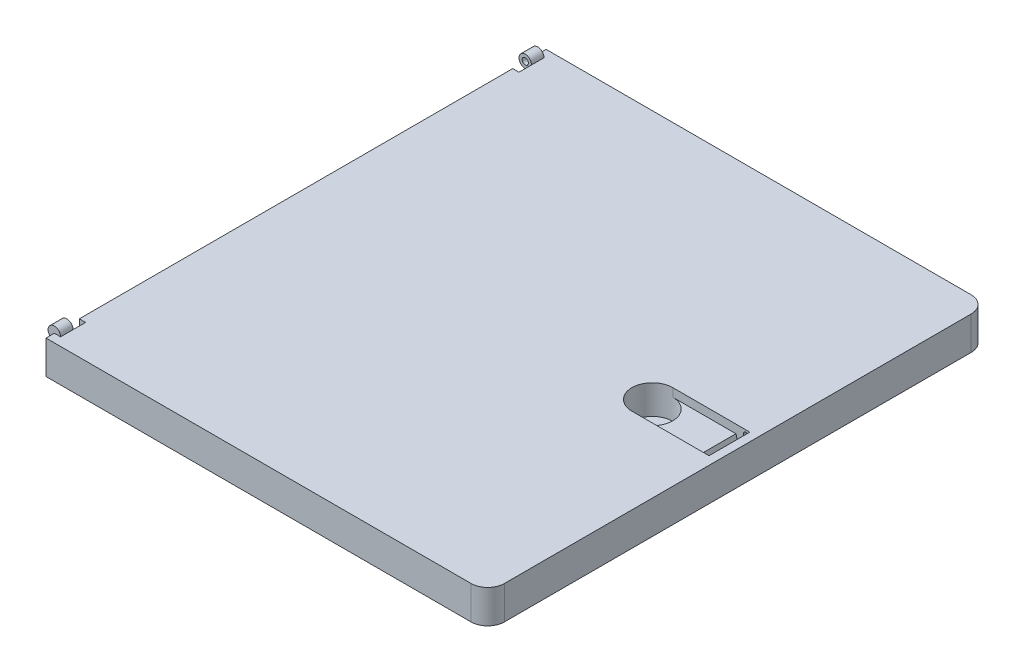
ISO-10303-21;
HEADER;
FILE_DESCRIPTION(('STEP AP214'),'2;1');
FILE_NAME('part.step','',(''),(''),'','','');
FILE_SCHEMA(('AUTOMOTIVE_DESIGN { 1 0 10303 214 1 1 1 1 }'));
ENDSEC;
DATA;
#1=APPLICATION_CONTEXT('core data for automotive mechanical design processes');
#2=APPLICATION_PROTOCOL_DEFINITION('international standard','automotive_design',2000,#1);
#3=PRODUCT_CONTEXT('',#1,'mechanical');
#4=PRODUCT('Part','Part','',(#3));
#5=PRODUCT_RELATED_PRODUCT_CATEGORY('part','',(#4));
#6=PRODUCT_DEFINITION_FORMATION('','',#4);
#7=PRODUCT_DEFINITION_CONTEXT('part definition',#1,'design');
#8=PRODUCT_DEFINITION('design','',#6,#7);
#9=PRODUCT_DEFINITION_SHAPE('','',#8);
#10=(LENGTH_UNIT() NAMED_UNIT(*) SI_UNIT(.MILLI.,.METRE.));
#11=(NAMED_UNIT(*) PLANE_ANGLE_UNIT() SI_UNIT($,.RADIAN.));
#12=(NAMED_UNIT(*) SI_UNIT($,.STERADIAN.) SOLID_ANGLE_UNIT());
#13=UNCERTAINTY_MEASURE_WITH_UNIT(LENGTH_MEASURE(1.E-05),#10,'distance_accuracy_value','');
#14=(GEOMETRIC_REPRESENTATION_CONTEXT(3) GLOBAL_UNCERTAINTY_ASSIGNED_CONTEXT((#13)) GLOBAL_UNIT_ASSIGNED_CONTEXT((#10,
#11,#12)) REPRESENTATION_CONTEXT('',''));
#15=CARTESIAN_POINT('',(0.,0.,0.));
#16=DIRECTION('',(0.,0.,1.));
#17=DIRECTION('',(1.,0.,0.));
#18=AXIS2_PLACEMENT_3D('',#15,#16,#17);
#19=CARTESIAN_POINT('',(-106.,-8.,0.));
#20=DIRECTION('',(-1.,0.,0.));
#21=DIRECTION('',(0.,0.,1.));
#22=AXIS2_PLACEMENT_3D('',#19,#20,#21);
#23=PLANE('',#22);
#24=DIRECTION('',(0.,-1.,0.));
#25=VECTOR('',#24,1.);
#26=CARTESIAN_POINT('',(-106.,-8.,-52.));
#27=LINE('',#26,#25);
#28=CARTESIAN_POINT('',(-106.,0.,-52.));
#29=VERTEX_POINT('',#28);
#30=CARTESIAN_POINT('',(-106.,-1.5,-52.));
#31=VERTEX_POINT('',#30);
#32=EDGE_CURVE('E476',#29,#31,#27,.T.);
#33=ORIENTED_EDGE('',*,*,#32,.T.);
#34=DIRECTION('',(0.,0.,-1.));
#35=VECTOR('',#34,1.);
#36=CARTESIAN_POINT('',(-106.,-1.5,-52.));
#37=LINE('',#36,#35);
#38=CARTESIAN_POINT('',(-106.,-1.5,-55.));
#39=VERTEX_POINT('',#38);
#40=EDGE_CURVE('E226',#31,#39,#37,.T.);
#41=ORIENTED_EDGE('',*,*,#40,.T.);
#42=DIRECTION('',(0.,0.,1.));
#43=VECTOR('',#42,1.);
#44=CARTESIAN_POINT('',(-106.,-1.5,-58.));
#45=LINE('',#44,#43);
#46=CARTESIAN_POINT('',(-106.,-1.5,-58.));
#47=VERTEX_POINT('',#46);
#48=EDGE_CURVE('E48',#47,#39,#45,.T.);
#49=ORIENTED_EDGE('',*,*,#48,.F.);
#50=DIRECTION('',(0.,-1.,0.));
#51=VECTOR('',#50,1.);
#52=CARTESIAN_POINT('',(-106.,-8.,-58.));
#53=LINE('',#52,#51);
#54=CARTESIAN_POINT('',(-106.,0.,-58.));
#55=VERTEX_POINT('',#54);
#56=EDGE_CURVE('E246',#55,#47,#53,.T.);
#57=ORIENTED_EDGE('',*,*,#56,.F.);
#58=DIRECTION('',(0.,0.,1.));
#59=VECTOR('',#58,1.);
#60=CARTESIAN_POINT('',(-106.,0.,0.));
#61=LINE('',#60,#59);
#62=CARTESIAN_POINT('',(-106.,0.,-60.));
#63=VERTEX_POINT('',#62);
#64=EDGE_CURVE('E411',#63,#55,#61,.T.);
#65=ORIENTED_EDGE('',*,*,#64,.F.);
#66=DIRECTION('',(0.,1.,0.));
#67=VECTOR('',#66,1.);
#68=CARTESIAN_POINT('',(-106.,-8.,-60.));
#69=LINE('',#68,#67);
#70=CARTESIAN_POINT('',(-106.,-8.,-60.));
#71=VERTEX_POINT('',#70);
#72=EDGE_CURVE('E405',#71,#63,#69,.T.);
#73=ORIENTED_EDGE('',*,*,#72,.F.);
#74=DIRECTION('',(0.,0.,1.));
#75=VECTOR('',#74,1.);
#76=CARTESIAN_POINT('',(-106.,-8.,0.));
#77=LINE('',#76,#75);
#78=CARTESIAN_POINT('',(-106.,-8.,60.));
#79=VERTEX_POINT('',#78);
#80=EDGE_CURVE('E400',#71,#79,#77,.T.);
#81=ORIENTED_EDGE('',*,*,#80,.T.);
#82=DIRECTION('',(0.,1.,0.));
#83=VECTOR('',#82,1.);
#84=CARTESIAN_POINT('',(-106.,-8.,60.));
#85=LINE('',#84,#83);
#86=CARTESIAN_POINT('',(-106.,0.,60.));
#87=VERTEX_POINT('',#86);
#88=EDGE_CURVE('E416',#79,#87,#85,.T.);
#89=ORIENTED_EDGE('',*,*,#88,.T.);
#90=CARTESIAN_POINT('',(-106.,0.,58.));
#91=VERTEX_POINT('',#90);
#92=EDGE_CURVE('E410',#91,#87,#61,.T.);
#93=ORIENTED_EDGE('',*,*,#92,.F.);
#94=DIRECTION('',(0.,1.,0.));
#95=VECTOR('',#94,1.);
#96=CARTESIAN_POINT('',(-106.,-8.,58.));
#97=LINE('',#96,#95);
#98=CARTESIAN_POINT('',(-106.,-1.5,58.));
#99=VERTEX_POINT('',#98);
#100=EDGE_CURVE('E278',#99,#91,#97,.T.);
#101=ORIENTED_EDGE('',*,*,#100,.F.);
#102=DIRECTION('',(0.,0.,-1.));
#103=VECTOR('',#102,1.);
#104=CARTESIAN_POINT('',(-106.,-1.5,58.));
#105=LINE('',#104,#103);
#106=CARTESIAN_POINT('',(-106.,-1.5,55.));
#107=VERTEX_POINT('',#106);
#108=EDGE_CURVE('E283',#99,#107,#105,.T.);
#109=ORIENTED_EDGE('',*,*,#108,.T.);
#110=DIRECTION('',(0.,0.,1.));
#111=VECTOR('',#110,1.);
#112=CARTESIAN_POINT('',(-106.,-1.5,52.));
#113=LINE('',#112,#111);
#114=CARTESIAN_POINT('',(-106.,-1.5,52.));
#115=VERTEX_POINT('',#114);
#116=EDGE_CURVE('E263',#115,#107,#113,.T.);
#117=ORIENTED_EDGE('',*,*,#116,.F.);
#118=DIRECTION('',(0.,1.,0.));
#119=VECTOR('',#118,1.);
#120=CARTESIAN_POINT('',(-106.,-8.,52.));
#121=LINE('',#120,#119);
#122=CARTESIAN_POINT('',(-106.,0.,52.));
#123=VERTEX_POINT('',#122);
#124=EDGE_CURVE('E265',#115,#123,#121,.T.);
#125=ORIENTED_EDGE('',*,*,#124,.T.);
#126=EDGE_CURVE('E413',#29,#123,#61,.T.);
#127=ORIENTED_EDGE('',*,*,#126,.F.);
#128=EDGE_LOOP('',(#33,#41,#49,#57,#65,#73,#81,#89,#93,#101,#109,#117,#125,#127));
#129=FACE_BOUND('',#128,.T.);
#130=ADVANCED_FACE('F33',(#129),#23,.T.);
#131=CARTESIAN_POINT('',(0.,0.,0.));
#132=DIRECTION('',(0.,-1.,0.));
#133=DIRECTION('',(0.,0.,-1.));
#134=AXIS2_PLACEMENT_3D('',#131,#132,#133);
#135=PLANE('',#134);
#136=DIRECTION('',(0.,0.,-1.));
#137=VECTOR('',#136,1.);
#138=CARTESIAN_POINT('',(-2.,0.,0.));
#139=LINE('',#138,#137);
#140=CARTESIAN_POINT('',(-2.,0.,4.9));
#141=VERTEX_POINT('',#140);
#142=CARTESIAN_POINT('',(-2.,0.,-4.9));
#143=VERTEX_POINT('',#142);
#144=EDGE_CURVE('E366',#141,#143,#139,.T.);
#145=ORIENTED_EDGE('',*,*,#144,.F.);
#146=DIRECTION('',(1.,0.,0.));
#147=VECTOR('',#146,1.);
#148=CARTESIAN_POINT('',(-2.,0.,4.9));
#149=LINE('',#148,#147);
#150=CARTESIAN_POINT('',(-20.5,0.,4.9));
#151=VERTEX_POINT('',#150);
#152=EDGE_CURVE('E372',#151,#141,#149,.T.);
#153=ORIENTED_EDGE('',*,*,#152,.F.);
#154=CARTESIAN_POINT('',(-20.5,0.,0.));
#155=DIRECTION('',(0.,1.,0.));
#156=DIRECTION('',(0.,0.,1.));
#157=AXIS2_PLACEMENT_3D('',#154,#155,#156);
#158=CIRCLE('',#157,4.9);
#159=CARTESIAN_POINT('',(-20.5,0.,-4.9));
#160=VERTEX_POINT('',#159);
#161=EDGE_CURVE('E381',#160,#151,#158,.T.);
#162=ORIENTED_EDGE('',*,*,#161,.F.);
#163=DIRECTION('',(-1.,0.,0.));
#164=VECTOR('',#163,1.);
#165=CARTESIAN_POINT('',(-2.,0.,-4.9));
#166=LINE('',#165,#164);
#167=EDGE_CURVE('E378',#143,#160,#166,.T.);
#168=ORIENTED_EDGE('',*,*,#167,.F.);
#169=EDGE_LOOP('',(#145,#153,#162,#168));
#170=FACE_BOUND('',#169,.T.);
#171=DIRECTION('',(0.,0.,-1.));
#172=VECTOR('',#171,1.);
#173=CARTESIAN_POINT('',(-104.5,0.,-52.));
#174=LINE('',#173,#172);
#175=CARTESIAN_POINT('',(-104.5,0.,-52.));
#176=VERTEX_POINT('',#175);
#177=CARTESIAN_POINT('',(-104.5,0.,-55.));
#178=VERTEX_POINT('',#177);
#179=EDGE_CURVE('E219',#176,#178,#174,.T.);
#180=ORIENTED_EDGE('',*,*,#179,.F.);
#181=DIRECTION('',(1.,0.,0.));
#182=VECTOR('',#181,1.);
#183=CARTESIAN_POINT('',(0.,0.,-52.));
#184=LINE('',#183,#182);
#185=EDGE_CURVE('E11',#29,#176,#184,.T.);
#186=ORIENTED_EDGE('',*,*,#185,.F.);
#187=ORIENTED_EDGE('',*,*,#126,.T.);
#188=DIRECTION('',(-1.,0.,0.));
#189=VECTOR('',#188,1.);
#190=CARTESIAN_POINT('',(0.,0.,52.));
#191=LINE('',#190,#189);
#192=CARTESIAN_POINT('',(-104.5,0.,52.));
#193=VERTEX_POINT('',#192);
#194=EDGE_CURVE('E240',#193,#123,#191,.T.);
#195=ORIENTED_EDGE('',*,*,#194,.F.);
#196=DIRECTION('',(0.,0.,1.));
#197=VECTOR('',#196,1.);
#198=CARTESIAN_POINT('',(-104.5,0.,52.));
#199=LINE('',#198,#197);
#200=CARTESIAN_POINT('',(-104.5,0.,55.));
#201=VERTEX_POINT('',#200);
#202=EDGE_CURVE('E259',#193,#201,#199,.T.);
#203=ORIENTED_EDGE('',*,*,#202,.T.);
#204=DIRECTION('',(0.,0.,-1.));
#205=VECTOR('',#204,1.);
#206=CARTESIAN_POINT('',(-104.5,0.,58.));
#207=LINE('',#206,#205);
#208=CARTESIAN_POINT('',(-104.5,0.,58.));
#209=VERTEX_POINT('',#208);
#210=EDGE_CURVE('E445',#209,#201,#207,.T.);
#211=ORIENTED_EDGE('',*,*,#210,.F.);
#212=DIRECTION('',(-1.,0.,0.));
#213=VECTOR('',#212,1.);
#214=CARTESIAN_POINT('',(0.,0.,58.));
#215=LINE('',#214,#213);
#216=EDGE_CURVE('E448',#209,#91,#215,.T.);
#217=ORIENTED_EDGE('',*,*,#216,.T.);
#218=ORIENTED_EDGE('',*,*,#92,.T.);
#219=DIRECTION('',(1.,0.,0.));
#220=VECTOR('',#219,1.);
#221=CARTESIAN_POINT('',(0.,0.,60.));
#222=LINE('',#221,#220);
#223=CARTESIAN_POINT('',(-4.,0.,60.));
#224=VERTEX_POINT('',#223);
#225=EDGE_CURVE('E398',#87,#224,#222,.T.);
#226=ORIENTED_EDGE('',*,*,#225,.T.);
#227=CARTESIAN_POINT('',(-4.,0.,56.));
#228=DIRECTION('',(0.,-1.,0.));
#229=DIRECTION('',(0.,0.,-1.));
#230=AXIS2_PLACEMENT_3D('',#227,#228,#229);
#231=CIRCLE('',#230,4.);
#232=CARTESIAN_POINT('',(0.,0.,56.));
#233=VERTEX_POINT('',#232);
#234=EDGE_CURVE('E426',#224,#233,#231,.F.);
#235=ORIENTED_EDGE('',*,*,#234,.T.);
#236=DIRECTION('',(0.,0.,-1.));
#237=VECTOR('',#236,1.);
#238=CARTESIAN_POINT('',(0.,0.,0.));
#239=LINE('',#238,#237);
#240=CARTESIAN_POINT('',(0.,0.,-56.));
#241=VERTEX_POINT('',#240);
#242=EDGE_CURVE('E388',#233,#241,#239,.T.);
#243=ORIENTED_EDGE('',*,*,#242,.T.);
#244=CARTESIAN_POINT('',(-4.,0.,-56.));
#245=DIRECTION('',(0.,-1.,0.));
#246=DIRECTION('',(0.,0.,-1.));
#247=AXIS2_PLACEMENT_3D('',#244,#245,#246);
#248=CIRCLE('',#247,4.);
#249=CARTESIAN_POINT('',(-4.,0.,-60.));
#250=VERTEX_POINT('',#249);
#251=EDGE_CURVE('E424',#241,#250,#248,.F.);
#252=ORIENTED_EDGE('',*,*,#251,.T.);
#253=DIRECTION('',(-1.,0.,0.));
#254=VECTOR('',#253,1.);
#255=CARTESIAN_POINT('',(0.,0.,-60.));
#256=LINE('',#255,#254);
#257=EDGE_CURVE('E408',#250,#63,#256,.T.);
#258=ORIENTED_EDGE('',*,*,#257,.T.);
#259=ORIENTED_EDGE('',*,*,#64,.T.);
#260=DIRECTION('',(1.,0.,0.));
#261=VECTOR('',#260,1.);
#262=CARTESIAN_POINT('',(0.,0.,-58.));
#263=LINE('',#262,#261);
#264=CARTESIAN_POINT('',(-104.5,0.,-58.));
#265=VERTEX_POINT('',#264);
#266=EDGE_CURVE('E41',#55,#265,#263,.T.);
#267=ORIENTED_EDGE('',*,*,#266,.T.);
#268=DIRECTION('',(0.,0.,1.));
#269=VECTOR('',#268,1.);
#270=CARTESIAN_POINT('',(-104.5,0.,-58.));
#271=LINE('',#270,#269);
#272=EDGE_CURVE('E235',#265,#178,#271,.T.);
#273=ORIENTED_EDGE('',*,*,#272,.T.);
#274=EDGE_LOOP('',(#180,#186,#187,#195,#203,#211,#217,#218,#226,#235,#243,#252,#258,#259,#267,#273));
#275=FACE_BOUND('',#274,.T.);
#276=ADVANCED_FACE('F236',(#170,#275),#135,.F.);
#277=CARTESIAN_POINT('',(0.,-8.,60.));
#278=DIRECTION('',(0.,0.,1.));
#279=DIRECTION('',(1.,0.,0.));
#280=AXIS2_PLACEMENT_3D('',#277,#278,#279);
#281=PLANE('',#280);
#282=DIRECTION('',(1.,0.,0.));
#283=VECTOR('',#282,1.);
#284=CARTESIAN_POINT('',(0.,-8.,60.));
#285=LINE('',#284,#283);
#286=CARTESIAN_POINT('',(-4.,-8.,60.));
#287=VERTEX_POINT('',#286);
#288=EDGE_CURVE('E402',#79,#287,#285,.T.);
#289=ORIENTED_EDGE('',*,*,#288,.T.);
#290=DIRECTION('',(0.,1.,0.));
#291=VECTOR('',#290,1.);
#292=CARTESIAN_POINT('',(-4.,-8.,60.));
#293=LINE('',#292,#291);
#294=EDGE_CURVE('E419',#287,#224,#293,.T.);
#295=ORIENTED_EDGE('',*,*,#294,.T.);
#296=ORIENTED_EDGE('',*,*,#225,.F.);
#297=ORIENTED_EDGE('',*,*,#88,.F.);
#298=EDGE_LOOP('',(#289,#295,#296,#297));
#299=FACE_BOUND('',#298,.T.);
#300=ADVANCED_FACE('F502',(#299),#281,.T.);
#301=CARTESIAN_POINT('',(0.,-8.,-60.));
#302=DIRECTION('',(0.,0.,-1.));
#303=DIRECTION('',(-1.,0.,0.));
#304=AXIS2_PLACEMENT_3D('',#301,#302,#303);
#305=PLANE('',#304);
#306=ORIENTED_EDGE('',*,*,#257,.F.);
#307=DIRECTION('',(0.,1.,0.));
#308=VECTOR('',#307,1.);
#309=CARTESIAN_POINT('',(-4.,-8.,-60.));
#310=LINE('',#309,#308);
#311=CARTESIAN_POINT('',(-4.,-8.,-60.));
#312=VERTEX_POINT('',#311);
#313=EDGE_CURVE('E437',#250,#312,#310,.F.);
#314=ORIENTED_EDGE('',*,*,#313,.T.);
#315=DIRECTION('',(-1.,0.,0.));
#316=VECTOR('',#315,1.);
#317=CARTESIAN_POINT('',(0.,-8.,-60.));
#318=LINE('',#317,#316);
#319=EDGE_CURVE('E397',#312,#71,#318,.T.);
#320=ORIENTED_EDGE('',*,*,#319,.T.);
#321=ORIENTED_EDGE('',*,*,#72,.T.);
#322=EDGE_LOOP('',(#306,#314,#320,#321));
#323=FACE_BOUND('',#322,.T.);
#324=ADVANCED_FACE('F507',(#323),#305,.T.);
#325=CARTESIAN_POINT('',(0.,-8.,0.));
#326=DIRECTION('',(1.,0.,0.));
#327=DIRECTION('',(0.,0.,-1.));
#328=AXIS2_PLACEMENT_3D('',#325,#326,#327);
#329=PLANE('',#328);
#330=ORIENTED_EDGE('',*,*,#242,.F.);
#331=DIRECTION('',(0.,1.,0.));
#332=VECTOR('',#331,1.);
#333=CARTESIAN_POINT('',(0.,-8.,56.));
#334=LINE('',#333,#332);
#335=CARTESIAN_POINT('',(0.,-8.,56.));
#336=VERTEX_POINT('',#335);
#337=EDGE_CURVE('E431',#233,#336,#334,.F.);
#338=ORIENTED_EDGE('',*,*,#337,.T.);
#339=DIRECTION('',(0.,0.,-1.));
#340=VECTOR('',#339,1.);
#341=CARTESIAN_POINT('',(0.,-8.,0.));
#342=LINE('',#341,#340);
#343=CARTESIAN_POINT('',(0.,-8.,-56.));
#344=VERTEX_POINT('',#343);
#345=EDGE_CURVE('E394',#336,#344,#342,.T.);
#346=ORIENTED_EDGE('',*,*,#345,.T.);
#347=DIRECTION('',(0.,1.,0.));
#348=VECTOR('',#347,1.);
#349=CARTESIAN_POINT('',(0.,-8.,-56.));
#350=LINE('',#349,#348);
#351=EDGE_CURVE('E428',#344,#241,#350,.T.);
#352=ORIENTED_EDGE('',*,*,#351,.T.);
#353=EDGE_LOOP('',(#330,#338,#346,#352));
#354=FACE_BOUND('',#353,.T.);
#355=ADVANCED_FACE('F510',(#354),#329,.T.);
#356=CARTESIAN_POINT('',(0.,-8.,0.));
#357=DIRECTION('',(0.,-1.,0.));
#358=DIRECTION('',(0.,0.,-1.));
#359=AXIS2_PLACEMENT_3D('',#356,#357,#358);
#360=PLANE('',#359);
#361=ORIENTED_EDGE('',*,*,#345,.F.);
#362=CARTESIAN_POINT('',(-4.,-8.,56.));
#363=DIRECTION('',(0.,-1.,0.));
#364=DIRECTION('',(0.,0.,-1.));
#365=AXIS2_PLACEMENT_3D('',#362,#363,#364);
#366=CIRCLE('',#365,4.);
#367=EDGE_CURVE('E435',#336,#287,#366,.T.);
#368=ORIENTED_EDGE('',*,*,#367,.T.);
#369=ORIENTED_EDGE('',*,*,#288,.F.);
#370=ORIENTED_EDGE('',*,*,#80,.F.);
#371=ORIENTED_EDGE('',*,*,#319,.F.);
#372=CARTESIAN_POINT('',(-4.,-8.,-56.));
#373=DIRECTION('',(0.,-1.,0.));
#374=DIRECTION('',(0.,0.,-1.));
#375=AXIS2_PLACEMENT_3D('',#372,#373,#374);
#376=CIRCLE('',#375,4.);
#377=EDGE_CURVE('E433',#312,#344,#376,.T.);
#378=ORIENTED_EDGE('',*,*,#377,.T.);
#379=EDGE_LOOP('',(#361,#368,#369,#370,#371,#378));
#380=FACE_BOUND('',#379,.T.);
#381=ADVANCED_FACE('F514',(#380),#360,.T.);
#382=CARTESIAN_POINT('',(-4.,-8.,56.));
#383=DIRECTION('',(0.,1.,0.));
#384=DIRECTION('',(0.,0.,1.));
#385=AXIS2_PLACEMENT_3D('',#382,#383,#384);
#386=CYLINDRICAL_SURFACE('',#385,4.);
#387=ORIENTED_EDGE('',*,*,#367,.F.);
#388=ORIENTED_EDGE('',*,*,#337,.F.);
#389=ORIENTED_EDGE('',*,*,#234,.F.);
#390=ORIENTED_EDGE('',*,*,#294,.F.);
#391=EDGE_LOOP('',(#387,#388,#389,#390));
#392=FACE_BOUND('',#391,.T.);
#393=ADVANCED_FACE('F516',(#392),#386,.T.);
#394=CARTESIAN_POINT('',(-4.,-8.,-56.));
#395=DIRECTION('',(0.,1.,0.));
#396=DIRECTION('',(0.,0.,1.));
#397=AXIS2_PLACEMENT_3D('',#394,#395,#396);
#398=CYLINDRICAL_SURFACE('',#397,4.);
#399=ORIENTED_EDGE('',*,*,#377,.F.);
#400=ORIENTED_EDGE('',*,*,#313,.F.);
#401=ORIENTED_EDGE('',*,*,#251,.F.);
#402=ORIENTED_EDGE('',*,*,#351,.F.);
#403=EDGE_LOOP('',(#399,#400,#401,#402));
#404=FACE_BOUND('',#403,.T.);
#405=ADVANCED_FACE('F518',(#404),#398,.T.);
#406=CARTESIAN_POINT('',(-2.,-2.,4.9));
#407=DIRECTION('',(0.,0.,1.));
#408=DIRECTION('',(1.,0.,0.));
#409=AXIS2_PLACEMENT_3D('',#406,#407,#408);
#410=PLANE('',#409);
#411=DIRECTION('',(0.,-1.,0.));
#412=VECTOR('',#411,1.);
#413=CARTESIAN_POINT('',(-2.5,-1.,4.9));
#414=LINE('',#413,#412);
#415=CARTESIAN_POINT('',(-2.5,-1.,4.9));
#416=VERTEX_POINT('',#415);
#417=CARTESIAN_POINT('',(-2.5,-6.,4.9));
#418=VERTEX_POINT('',#417);
#419=EDGE_CURVE('E302',#416,#418,#414,.T.);
#420=ORIENTED_EDGE('',*,*,#419,.F.);
#421=CARTESIAN_POINT('',(-3.,-1.,4.9));
#422=DIRECTION('',(0.,0.,-1.));
#423=DIRECTION('',(-1.,0.,0.));
#424=AXIS2_PLACEMENT_3D('',#421,#422,#423);
#425=CIRCLE('',#424,0.5);
#426=CARTESIAN_POINT('',(-3.5,-1.,4.9));
#427=VERTEX_POINT('',#426);
#428=EDGE_CURVE('E286',#427,#416,#425,.T.);
#429=ORIENTED_EDGE('',*,*,#428,.F.);
#430=DIRECTION('',(0.,1.,0.));
#431=VECTOR('',#430,1.);
#432=CARTESIAN_POINT('',(-3.5,-1.,4.9));
#433=LINE('',#432,#431);
#434=CARTESIAN_POINT('',(-3.5,-6.,4.9));
#435=VERTEX_POINT('',#434);
#436=EDGE_CURVE('E291',#435,#427,#433,.T.);
#437=ORIENTED_EDGE('',*,*,#436,.F.);
#438=CARTESIAN_POINT('',(-3.,-6.,4.9));
#439=DIRECTION('',(0.,0.,-1.));
#440=DIRECTION('',(-1.,0.,0.));
#441=AXIS2_PLACEMENT_3D('',#438,#439,#440);
#442=CIRCLE('',#441,0.5);
#443=EDGE_CURVE('E305',#418,#435,#442,.T.);
#444=ORIENTED_EDGE('',*,*,#443,.F.);
#445=EDGE_LOOP('',(#420,#429,#437,#444));
#446=FACE_BOUND('',#445,.T.);
#447=ORIENTED_EDGE('',*,*,#152,.T.);
#448=DIRECTION('',(0.,1.,0.));
#449=VECTOR('',#448,1.);
#450=CARTESIAN_POINT('',(-2.,-2.,4.9));
#451=LINE('',#450,#449);
#452=CARTESIAN_POINT('',(-2.,-7.,4.9));
#453=VERTEX_POINT('',#452);
#454=EDGE_CURVE('E385',#453,#141,#451,.T.);
#455=ORIENTED_EDGE('',*,*,#454,.F.);
#456=DIRECTION('',(1.,0.,0.));
#457=VECTOR('',#456,1.);
#458=CARTESIAN_POINT('',(-2.,-7.,4.9));
#459=LINE('',#458,#457);
#460=CARTESIAN_POINT('',(-4.,-7.,4.9));
#461=VERTEX_POINT('',#460);
#462=EDGE_CURVE('E359',#461,#453,#459,.T.);
#463=ORIENTED_EDGE('',*,*,#462,.F.);
#464=DIRECTION('',(-0.258819045102518,0.965925826289069,0.));
#465=VECTOR('',#464,1.);
#466=CARTESIAN_POINT('',(-5.11602540378444,-2.83493649053889,4.9));
#467=LINE('',#466,#465);
#468=CARTESIAN_POINT('',(-5.33974596215561,-2.,4.9));
#469=VERTEX_POINT('',#468);
#470=EDGE_CURVE('E441',#461,#469,#467,.T.);
#471=ORIENTED_EDGE('',*,*,#470,.T.);
#472=DIRECTION('',(1.,0.,0.));
#473=VECTOR('',#472,1.);
#474=CARTESIAN_POINT('',(-2.,-2.,4.9));
#475=LINE('',#474,#473);
#476=CARTESIAN_POINT('',(-20.5,-2.,4.9));
#477=VERTEX_POINT('',#476);
#478=EDGE_CURVE('E371',#477,#469,#475,.T.);
#479=ORIENTED_EDGE('',*,*,#478,.F.);
#480=DIRECTION('',(0.,1.,0.));
#481=VECTOR('',#480,1.);
#482=CARTESIAN_POINT('',(-20.5,-2.,4.9));
#483=LINE('',#482,#481);
#484=EDGE_CURVE('E389',#477,#151,#483,.T.);
#485=ORIENTED_EDGE('',*,*,#484,.T.);
#486=EDGE_LOOP('',(#447,#455,#463,#471,#479,#485));
#487=FACE_BOUND('',#486,.T.);
#488=ADVANCED_FACE('F521',(#446,#487),#410,.F.);
#489=CARTESIAN_POINT('',(-20.5,-2.,0.));
#490=DIRECTION('',(0.,1.,0.));
#491=DIRECTION('',(0.,0.,1.));
#492=AXIS2_PLACEMENT_3D('',#489,#490,#491);
#493=CYLINDRICAL_SURFACE('',#492,4.9);
#494=ORIENTED_EDGE('',*,*,#161,.T.);
#495=ORIENTED_EDGE('',*,*,#484,.F.);
#496=CARTESIAN_POINT('',(-20.5,-2.,0.));
#497=DIRECTION('',(0.,1.,0.));
#498=DIRECTION('',(0.,0.,1.));
#499=AXIS2_PLACEMENT_3D('',#496,#497,#498);
#500=CIRCLE('',#499,4.9);
#501=CARTESIAN_POINT('',(-20.5,-2.,-4.9));
#502=VERTEX_POINT('',#501);
#503=EDGE_CURVE('E362',#477,#502,#500,.T.);
#504=ORIENTED_EDGE('',*,*,#503,.T.);
#505=DIRECTION('',(0.,1.,0.));
#506=VECTOR('',#505,1.);
#507=CARTESIAN_POINT('',(-20.5,-2.,-4.9));
#508=LINE('',#507,#506);
#509=EDGE_CURVE('E391',#502,#160,#508,.T.);
#510=ORIENTED_EDGE('',*,*,#509,.T.);
#511=EDGE_LOOP('',(#494,#495,#504,#510));
#512=FACE_BOUND('',#511,.T.);
#513=CARTESIAN_POINT('',(-20.5,-7.,0.));
#514=DIRECTION('',(0.,1.,0.));
#515=DIRECTION('',(0.,0.,1.));
#516=AXIS2_PLACEMENT_3D('',#513,#514,#515);
#517=CIRCLE('',#516,4.9);
#518=CARTESIAN_POINT('',(-20.5,-7.,4.9));
#519=VERTEX_POINT('',#518);
#520=EDGE_CURVE('E363',#519,#519,#517,.T.);
#521=ORIENTED_EDGE('',*,*,#520,.F.);
#522=EDGE_LOOP('',(#521));
#523=FACE_BOUND('',#522,.T.);
#524=ADVANCED_FACE('F526',(#512,#523),#493,.F.);
#525=CARTESIAN_POINT('',(-2.,-2.,-4.9));
#526=DIRECTION('',(0.,0.,-1.));
#527=DIRECTION('',(-1.,0.,0.));
#528=AXIS2_PLACEMENT_3D('',#525,#526,#527);
#529=PLANE('',#528);
#530=DIRECTION('',(0.,-1.,0.));
#531=VECTOR('',#530,1.);
#532=CARTESIAN_POINT('',(-3.5,-1.,-4.9));
#533=LINE('',#532,#531);
#534=CARTESIAN_POINT('',(-3.5,-1.,-4.9));
#535=VERTEX_POINT('',#534);
#536=CARTESIAN_POINT('',(-3.5,-6.,-4.9));
#537=VERTEX_POINT('',#536);
#538=EDGE_CURVE('E334',#535,#537,#533,.T.);
#539=ORIENTED_EDGE('',*,*,#538,.F.);
#540=CARTESIAN_POINT('',(-3.,-1.,-4.9));
#541=DIRECTION('',(0.,0.,1.));
#542=DIRECTION('',(1.,0.,0.));
#543=AXIS2_PLACEMENT_3D('',#540,#541,#542);
#544=CIRCLE('',#543,0.5);
#545=CARTESIAN_POINT('',(-2.5,-1.,-4.9));
#546=VERTEX_POINT('',#545);
#547=EDGE_CURVE('E312',#546,#535,#544,.T.);
#548=ORIENTED_EDGE('',*,*,#547,.F.);
#549=DIRECTION('',(0.,1.,0.));
#550=VECTOR('',#549,1.);
#551=CARTESIAN_POINT('',(-2.5,-6.,-4.9));
#552=LINE('',#551,#550);
#553=CARTESIAN_POINT('',(-2.5,-6.,-4.9));
#554=VERTEX_POINT('',#553);
#555=EDGE_CURVE('E323',#554,#546,#552,.T.);
#556=ORIENTED_EDGE('',*,*,#555,.F.);
#557=CARTESIAN_POINT('',(-3.,-6.,-4.9));
#558=DIRECTION('',(0.,0.,1.));
#559=DIRECTION('',(1.,0.,0.));
#560=AXIS2_PLACEMENT_3D('',#557,#558,#559);
#561=CIRCLE('',#560,0.5);
#562=EDGE_CURVE('E337',#537,#554,#561,.T.);
#563=ORIENTED_EDGE('',*,*,#562,.F.);
#564=EDGE_LOOP('',(#539,#548,#556,#563));
#565=FACE_BOUND('',#564,.T.);
#566=ORIENTED_EDGE('',*,*,#167,.T.);
#567=ORIENTED_EDGE('',*,*,#509,.F.);
#568=DIRECTION('',(-1.,0.,0.));
#569=VECTOR('',#568,1.);
#570=CARTESIAN_POINT('',(-2.,-2.,-4.9));
#571=LINE('',#570,#569);
#572=CARTESIAN_POINT('',(-5.33974596215561,-2.,-4.9));
#573=VERTEX_POINT('',#572);
#574=EDGE_CURVE('E369',#573,#502,#571,.T.);
#575=ORIENTED_EDGE('',*,*,#574,.F.);
#576=DIRECTION('',(0.258819045102518,-0.965925826289069,0.));
#577=VECTOR('',#576,1.);
#578=CARTESIAN_POINT('',(-5.11602540378444,-2.83493649053889,-4.9));
#579=LINE('',#578,#577);
#580=CARTESIAN_POINT('',(-4.,-7.,-4.9));
#581=VERTEX_POINT('',#580);
#582=EDGE_CURVE('E443',#573,#581,#579,.T.);
#583=ORIENTED_EDGE('',*,*,#582,.T.);
#584=DIRECTION('',(-1.,0.,0.));
#585=VECTOR('',#584,1.);
#586=CARTESIAN_POINT('',(-2.,-7.,-4.9));
#587=LINE('',#586,#585);
#588=CARTESIAN_POINT('',(-2.,-7.,-4.9));
#589=VERTEX_POINT('',#588);
#590=EDGE_CURVE('E353',#589,#581,#587,.T.);
#591=ORIENTED_EDGE('',*,*,#590,.F.);
#592=DIRECTION('',(0.,1.,0.));
#593=VECTOR('',#592,1.);
#594=CARTESIAN_POINT('',(-2.,-2.,-4.9));
#595=LINE('',#594,#593);
#596=EDGE_CURVE('E375',#589,#143,#595,.T.);
#597=ORIENTED_EDGE('',*,*,#596,.T.);
#598=EDGE_LOOP('',(#566,#567,#575,#583,#591,#597));
#599=FACE_BOUND('',#598,.T.);
#600=ADVANCED_FACE('F582',(#565,#599),#529,.F.);
#601=CARTESIAN_POINT('',(-2.,-2.,0.));
#602=DIRECTION('',(1.,0.,0.));
#603=DIRECTION('',(0.,0.,-1.));
#604=AXIS2_PLACEMENT_3D('',#601,#602,#603);
#605=PLANE('',#604);
#606=ORIENTED_EDGE('',*,*,#144,.T.);
#607=ORIENTED_EDGE('',*,*,#596,.F.);
#608=DIRECTION('',(0.,0.,-1.));
#609=VECTOR('',#608,1.);
#610=CARTESIAN_POINT('',(-2.,-7.,-4.9));
#611=LINE('',#610,#609);
#612=EDGE_CURVE('E344',#453,#589,#611,.T.);
#613=ORIENTED_EDGE('',*,*,#612,.F.);
#614=ORIENTED_EDGE('',*,*,#454,.T.);
#615=EDGE_LOOP('',(#606,#607,#613,#614));
#616=FACE_BOUND('',#615,.T.);
#617=ADVANCED_FACE('F592',(#616),#605,.F.);
#618=CARTESIAN_POINT('',(-20.5,-2.,0.));
#619=DIRECTION('',(0.,1.,0.));
#620=DIRECTION('',(0.,0.,1.));
#621=AXIS2_PLACEMENT_3D('',#618,#619,#620);
#622=PLANE('',#621);
#623=ORIENTED_EDGE('',*,*,#478,.T.);
#624=DIRECTION('',(0.,0.,-1.));
#625=VECTOR('',#624,1.);
#626=CARTESIAN_POINT('',(-5.33974596215561,-2.,-4.9));
#627=LINE('',#626,#625);
#628=EDGE_CURVE('E439',#469,#573,#627,.T.);
#629=ORIENTED_EDGE('',*,*,#628,.T.);
#630=ORIENTED_EDGE('',*,*,#574,.T.);
#631=ORIENTED_EDGE('',*,*,#503,.F.);
#632=EDGE_LOOP('',(#623,#629,#630,#631));
#633=FACE_BOUND('',#632,.T.);
#634=ADVANCED_FACE('F597',(#633),#622,.T.);
#635=CARTESIAN_POINT('',(-20.5,-7.,0.));
#636=DIRECTION('',(0.,1.,0.));
#637=DIRECTION('',(0.,0.,1.));
#638=AXIS2_PLACEMENT_3D('',#635,#636,#637);
#639=PLANE('',#638);
#640=ORIENTED_EDGE('',*,*,#520,.T.);
#641=EDGE_LOOP('',(#640));
#642=FACE_BOUND('',#641,.T.);
#643=ADVANCED_FACE('F606',(#642),#639,.T.);
#644=CARTESIAN_POINT('',(0.,-7.,0.));
#645=DIRECTION('',(0.,-1.,0.));
#646=DIRECTION('',(0.,0.,-1.));
#647=AXIS2_PLACEMENT_3D('',#644,#645,#646);
#648=PLANE('',#647);
#649=ORIENTED_EDGE('',*,*,#612,.T.);
#650=ORIENTED_EDGE('',*,*,#590,.T.);
#651=DIRECTION('',(0.,0.,1.));
#652=VECTOR('',#651,1.);
#653=CARTESIAN_POINT('',(-4.,-7.,-4.9));
#654=LINE('',#653,#652);
#655=EDGE_CURVE('E356',#581,#461,#654,.T.);
#656=ORIENTED_EDGE('',*,*,#655,.T.);
#657=ORIENTED_EDGE('',*,*,#462,.T.);
#658=EDGE_LOOP('',(#649,#650,#656,#657));
#659=FACE_BOUND('',#658,.T.);
#660=ADVANCED_FACE('F610',(#659),#648,.F.);
#661=CARTESIAN_POINT('',(-3.,-1.,-6.9));
#662=DIRECTION('',(0.,0.,1.));
#663=DIRECTION('',(1.,0.,0.));
#664=AXIS2_PLACEMENT_3D('',#661,#662,#663);
#665=CYLINDRICAL_SURFACE('',#664,0.5);
#666=ORIENTED_EDGE('',*,*,#547,.T.);
#667=DIRECTION('',(0.,0.,1.));
#668=VECTOR('',#667,1.);
#669=CARTESIAN_POINT('',(-3.5,-1.,-6.9));
#670=LINE('',#669,#668);
#671=CARTESIAN_POINT('',(-3.5,-1.,-6.9));
#672=VERTEX_POINT('',#671);
#673=EDGE_CURVE('E332',#672,#535,#670,.T.);
#674=ORIENTED_EDGE('',*,*,#673,.F.);
#675=CARTESIAN_POINT('',(-3.,-1.,-6.9));
#676=DIRECTION('',(0.,0.,1.));
#677=DIRECTION('',(1.,0.,0.));
#678=AXIS2_PLACEMENT_3D('',#675,#676,#677);
#679=CIRCLE('',#678,0.5);
#680=CARTESIAN_POINT('',(-2.5,-1.,-6.9));
#681=VERTEX_POINT('',#680);
#682=EDGE_CURVE('E319',#681,#672,#679,.T.);
#683=ORIENTED_EDGE('',*,*,#682,.F.);
#684=DIRECTION('',(0.,0.,1.));
#685=VECTOR('',#684,1.);
#686=CARTESIAN_POINT('',(-2.5,-1.,-6.9));
#687=LINE('',#686,#685);
#688=EDGE_CURVE('E342',#681,#546,#687,.T.);
#689=ORIENTED_EDGE('',*,*,#688,.T.);
#690=EDGE_LOOP('',(#666,#674,#683,#689));
#691=FACE_BOUND('',#690,.T.);
#692=ADVANCED_FACE('F618',(#691),#665,.F.);
#693=CARTESIAN_POINT('',(-2.5,-6.,-6.9));
#694=DIRECTION('',(1.,0.,0.));
#695=DIRECTION('',(0.,0.,-1.));
#696=AXIS2_PLACEMENT_3D('',#693,#694,#695);
#697=PLANE('',#696);
#698=ORIENTED_EDGE('',*,*,#555,.T.);
#699=ORIENTED_EDGE('',*,*,#688,.F.);
#700=DIRECTION('',(0.,1.,0.));
#701=VECTOR('',#700,1.);
#702=CARTESIAN_POINT('',(-2.5,-6.,-6.9));
#703=LINE('',#702,#701);
#704=CARTESIAN_POINT('',(-2.5,-6.,-6.9));
#705=VERTEX_POINT('',#704);
#706=EDGE_CURVE('E329',#705,#681,#703,.T.);
#707=ORIENTED_EDGE('',*,*,#706,.F.);
#708=DIRECTION('',(0.,0.,1.));
#709=VECTOR('',#708,1.);
#710=CARTESIAN_POINT('',(-2.5,-6.,-6.9));
#711=LINE('',#710,#709);
#712=EDGE_CURVE('E345',#705,#554,#711,.T.);
#713=ORIENTED_EDGE('',*,*,#712,.T.);
#714=EDGE_LOOP('',(#698,#699,#707,#713));
#715=FACE_BOUND('',#714,.T.);
#716=ADVANCED_FACE('F623',(#715),#697,.F.);
#717=CARTESIAN_POINT('',(-3.,-6.,-6.9));
#718=DIRECTION('',(0.,0.,1.));
#719=DIRECTION('',(1.,0.,0.));
#720=AXIS2_PLACEMENT_3D('',#717,#718,#719);
#721=CYLINDRICAL_SURFACE('',#720,0.5);
#722=ORIENTED_EDGE('',*,*,#562,.T.);
#723=ORIENTED_EDGE('',*,*,#712,.F.);
#724=CARTESIAN_POINT('',(-3.,-6.,-6.9));
#725=DIRECTION('',(0.,0.,1.));
#726=DIRECTION('',(1.,0.,0.));
#727=AXIS2_PLACEMENT_3D('',#724,#725,#726);
#728=CIRCLE('',#727,0.5);
#729=CARTESIAN_POINT('',(-3.5,-6.,-6.9));
#730=VERTEX_POINT('',#729);
#731=EDGE_CURVE('E326',#730,#705,#728,.T.);
#732=ORIENTED_EDGE('',*,*,#731,.F.);
#733=DIRECTION('',(0.,0.,1.));
#734=VECTOR('',#733,1.);
#735=CARTESIAN_POINT('',(-3.5,-6.,-6.9));
#736=LINE('',#735,#734);
#737=EDGE_CURVE('E347',#730,#537,#736,.T.);
#738=ORIENTED_EDGE('',*,*,#737,.T.);
#739=EDGE_LOOP('',(#722,#723,#732,#738));
#740=FACE_BOUND('',#739,.T.);
#741=ADVANCED_FACE('F633',(#740),#721,.F.);
#742=CARTESIAN_POINT('',(-3.5,-1.,-6.9));
#743=DIRECTION('',(-1.,0.,0.));
#744=DIRECTION('',(0.,0.,1.));
#745=AXIS2_PLACEMENT_3D('',#742,#743,#744);
#746=PLANE('',#745);
#747=ORIENTED_EDGE('',*,*,#538,.T.);
#748=ORIENTED_EDGE('',*,*,#737,.F.);
#749=DIRECTION('',(0.,-1.,0.));
#750=VECTOR('',#749,1.);
#751=CARTESIAN_POINT('',(-3.5,-1.,-6.9));
#752=LINE('',#751,#750);
#753=EDGE_CURVE('E322',#672,#730,#752,.T.);
#754=ORIENTED_EDGE('',*,*,#753,.F.);
#755=ORIENTED_EDGE('',*,*,#673,.T.);
#756=EDGE_LOOP('',(#747,#748,#754,#755));
#757=FACE_BOUND('',#756,.T.);
#758=ADVANCED_FACE('F643',(#757),#746,.F.);
#759=CARTESIAN_POINT('',(-3.,-1.,-6.9));
#760=DIRECTION('',(0.,0.,1.));
#761=DIRECTION('',(1.,0.,0.));
#762=AXIS2_PLACEMENT_3D('',#759,#760,#761);
#763=PLANE('',#762);
#764=ORIENTED_EDGE('',*,*,#682,.T.);
#765=ORIENTED_EDGE('',*,*,#753,.T.);
#766=ORIENTED_EDGE('',*,*,#731,.T.);
#767=ORIENTED_EDGE('',*,*,#706,.T.);
#768=EDGE_LOOP('',(#764,#765,#766,#767));
#769=FACE_BOUND('',#768,.T.);
#770=ADVANCED_FACE('F653',(#769),#763,.T.);
#771=CARTESIAN_POINT('',(-3.,-1.,6.9));
#772=DIRECTION('',(0.,0.,-1.));
#773=DIRECTION('',(-1.,0.,0.));
#774=AXIS2_PLACEMENT_3D('',#771,#772,#773);
#775=CYLINDRICAL_SURFACE('',#774,0.5);
#776=ORIENTED_EDGE('',*,*,#428,.T.);
#777=DIRECTION('',(0.,0.,-1.));
#778=VECTOR('',#777,1.);
#779=CARTESIAN_POINT('',(-2.5,-1.,6.9));
#780=LINE('',#779,#778);
#781=CARTESIAN_POINT('',(-2.5,-1.,6.9));
#782=VERTEX_POINT('',#781);
#783=EDGE_CURVE('E300',#782,#416,#780,.T.);
#784=ORIENTED_EDGE('',*,*,#783,.F.);
#785=CARTESIAN_POINT('',(-3.,-1.,6.9));
#786=DIRECTION('',(0.,0.,-1.));
#787=DIRECTION('',(-1.,0.,0.));
#788=AXIS2_PLACEMENT_3D('',#785,#786,#787);
#789=CIRCLE('',#788,0.5);
#790=CARTESIAN_POINT('',(-3.5,-1.,6.9));
#791=VERTEX_POINT('',#790);
#792=EDGE_CURVE('E287',#791,#782,#789,.T.);
#793=ORIENTED_EDGE('',*,*,#792,.F.);
#794=DIRECTION('',(0.,0.,-1.));
#795=VECTOR('',#794,1.);
#796=CARTESIAN_POINT('',(-3.5,-1.,6.9));
#797=LINE('',#796,#795);
#798=EDGE_CURVE('E310',#791,#427,#797,.T.);
#799=ORIENTED_EDGE('',*,*,#798,.T.);
#800=EDGE_LOOP('',(#776,#784,#793,#799));
#801=FACE_BOUND('',#800,.T.);
#802=ADVANCED_FACE('F663',(#801),#775,.F.);
#803=CARTESIAN_POINT('',(-3.5,-1.,6.9));
#804=DIRECTION('',(-1.,0.,0.));
#805=DIRECTION('',(0.,0.,1.));
#806=AXIS2_PLACEMENT_3D('',#803,#804,#805);
#807=PLANE('',#806);
#808=ORIENTED_EDGE('',*,*,#436,.T.);
#809=ORIENTED_EDGE('',*,*,#798,.F.);
#810=DIRECTION('',(0.,1.,0.));
#811=VECTOR('',#810,1.);
#812=CARTESIAN_POINT('',(-3.5,-1.,6.9));
#813=LINE('',#812,#811);
#814=CARTESIAN_POINT('',(-3.5,-6.,6.9));
#815=VERTEX_POINT('',#814);
#816=EDGE_CURVE('E297',#815,#791,#813,.T.);
#817=ORIENTED_EDGE('',*,*,#816,.F.);
#818=DIRECTION('',(0.,0.,-1.));
#819=VECTOR('',#818,1.);
#820=CARTESIAN_POINT('',(-3.5,-6.,6.9));
#821=LINE('',#820,#819);
#822=EDGE_CURVE('E313',#815,#435,#821,.T.);
#823=ORIENTED_EDGE('',*,*,#822,.T.);
#824=EDGE_LOOP('',(#808,#809,#817,#823));
#825=FACE_BOUND('',#824,.T.);
#826=ADVANCED_FACE('F673',(#825),#807,.F.);
#827=CARTESIAN_POINT('',(-3.,-6.,6.9));
#828=DIRECTION('',(0.,0.,-1.));
#829=DIRECTION('',(-1.,0.,0.));
#830=AXIS2_PLACEMENT_3D('',#827,#828,#829);
#831=CYLINDRICAL_SURFACE('',#830,0.5);
#832=ORIENTED_EDGE('',*,*,#443,.T.);
#833=ORIENTED_EDGE('',*,*,#822,.F.);
#834=CARTESIAN_POINT('',(-3.,-6.,6.9));
#835=DIRECTION('',(0.,0.,-1.));
#836=DIRECTION('',(-1.,0.,0.));
#837=AXIS2_PLACEMENT_3D('',#834,#835,#836);
#838=CIRCLE('',#837,0.5);
#839=CARTESIAN_POINT('',(-2.5,-6.,6.9));
#840=VERTEX_POINT('',#839);
#841=EDGE_CURVE('E294',#840,#815,#838,.T.);
#842=ORIENTED_EDGE('',*,*,#841,.F.);
#843=DIRECTION('',(0.,0.,-1.));
#844=VECTOR('',#843,1.);
#845=CARTESIAN_POINT('',(-2.5,-6.,6.9));
#846=LINE('',#845,#844);
#847=EDGE_CURVE('E315',#840,#418,#846,.T.);
#848=ORIENTED_EDGE('',*,*,#847,.T.);
#849=EDGE_LOOP('',(#832,#833,#842,#848));
#850=FACE_BOUND('',#849,.T.);
#851=ADVANCED_FACE('F683',(#850),#831,.F.);
#852=CARTESIAN_POINT('',(-2.5,-1.,6.9));
#853=DIRECTION('',(1.,0.,0.));
#854=DIRECTION('',(0.,0.,-1.));
#855=AXIS2_PLACEMENT_3D('',#852,#853,#854);
#856=PLANE('',#855);
#857=ORIENTED_EDGE('',*,*,#419,.T.);
#858=ORIENTED_EDGE('',*,*,#847,.F.);
#859=DIRECTION('',(0.,-1.,0.));
#860=VECTOR('',#859,1.);
#861=CARTESIAN_POINT('',(-2.5,-1.,6.9));
#862=LINE('',#861,#860);
#863=EDGE_CURVE('E290',#782,#840,#862,.T.);
#864=ORIENTED_EDGE('',*,*,#863,.F.);
#865=ORIENTED_EDGE('',*,*,#783,.T.);
#866=EDGE_LOOP('',(#857,#858,#864,#865));
#867=FACE_BOUND('',#866,.T.);
#868=ADVANCED_FACE('F693',(#867),#856,.F.);
#869=CARTESIAN_POINT('',(-3.,-1.,6.9));
#870=DIRECTION('',(0.,0.,-1.));
#871=DIRECTION('',(-1.,0.,0.));
#872=AXIS2_PLACEMENT_3D('',#869,#870,#871);
#873=PLANE('',#872);
#874=ORIENTED_EDGE('',*,*,#792,.T.);
#875=ORIENTED_EDGE('',*,*,#863,.T.);
#876=ORIENTED_EDGE('',*,*,#841,.T.);
#877=ORIENTED_EDGE('',*,*,#816,.T.);
#878=EDGE_LOOP('',(#874,#875,#876,#877));
#879=FACE_BOUND('',#878,.T.);
#880=ADVANCED_FACE('F703',(#879),#873,.T.);
#881=CARTESIAN_POINT('',(-4.,-7.00000000000003,-4.9));
#882=DIRECTION('',(0.965925826289069,0.258819045102518,0.));
#883=DIRECTION('',(0.,0.,-1.));
#884=AXIS2_PLACEMENT_3D('',#881,#882,#883);
#885=PLANE('',#884);
#886=ORIENTED_EDGE('',*,*,#582,.F.);
#887=ORIENTED_EDGE('',*,*,#628,.F.);
#888=ORIENTED_EDGE('',*,*,#470,.F.);
#889=ORIENTED_EDGE('',*,*,#655,.F.);
#890=EDGE_LOOP('',(#886,#887,#888,#889));
#891=FACE_BOUND('',#890,.T.);
#892=ADVANCED_FACE('F35',(#891),#885,.T.);
#893=CARTESIAN_POINT('',(-106.,0.,58.));
#894=DIRECTION('',(0.,0.,-1.));
#895=DIRECTION('',(-1.,0.,0.));
#896=AXIS2_PLACEMENT_3D('',#893,#894,#895);
#897=CYLINDRICAL_SURFACE('',#896,1.5);
#898=ORIENTED_EDGE('',*,*,#108,.F.);
#899=CARTESIAN_POINT('',(-106.,0.,58.));
#900=DIRECTION('',(0.,0.,1.));
#901=DIRECTION('',(1.,0.,0.));
#902=AXIS2_PLACEMENT_3D('',#899,#900,#901);
#903=CIRCLE('',#902,1.5);
#904=EDGE_CURVE('E275',#209,#99,#903,.T.);
#905=ORIENTED_EDGE('',*,*,#904,.F.);
#906=ORIENTED_EDGE('',*,*,#210,.T.);
#907=CARTESIAN_POINT('',(-106.,0.,55.));
#908=DIRECTION('',(0.,0.,1.));
#909=DIRECTION('',(1.,0.,0.));
#910=AXIS2_PLACEMENT_3D('',#907,#908,#909);
#911=CIRCLE('',#910,1.5);
#912=EDGE_CURVE('E272',#201,#107,#911,.T.);
#913=ORIENTED_EDGE('',*,*,#912,.T.);
#914=EDGE_LOOP('',(#898,#905,#906,#913));
#915=FACE_BOUND('',#914,.T.);
#916=ADVANCED_FACE('F466',(#915),#897,.T.);
#917=CARTESIAN_POINT('',(-106.,0.,58.));
#918=DIRECTION('',(0.,0.,1.));
#919=DIRECTION('',(1.,0.,0.));
#920=AXIS2_PLACEMENT_3D('',#917,#918,#919);
#921=PLANE('',#920);
#922=ORIENTED_EDGE('',*,*,#904,.T.);
#923=ORIENTED_EDGE('',*,*,#100,.T.);
#924=ORIENTED_EDGE('',*,*,#216,.F.);
#925=EDGE_LOOP('',(#922,#923,#924));
#926=FACE_BOUND('',#925,.T.);
#927=ADVANCED_FACE('F471',(#926),#921,.T.);
#928=CARTESIAN_POINT('',(-106.,0.,55.));
#929=DIRECTION('',(0.,0.,1.));
#930=DIRECTION('',(1.,0.,0.));
#931=AXIS2_PLACEMENT_3D('',#928,#929,#930);
#932=PLANE('',#931);
#933=CARTESIAN_POINT('',(-106.,0.,55.));
#934=DIRECTION('',(0.,0.,1.));
#935=DIRECTION('',(1.,0.,0.));
#936=AXIS2_PLACEMENT_3D('',#933,#934,#935);
#937=CIRCLE('',#936,0.749999999999999);
#938=CARTESIAN_POINT('',(-105.25,0.,55.));
#939=VERTEX_POINT('',#938);
#940=EDGE_CURVE('E268',#939,#939,#937,.T.);
#941=ORIENTED_EDGE('',*,*,#940,.T.);
#942=EDGE_LOOP('',(#941));
#943=FACE_BOUND('',#942,.T.);
#944=CARTESIAN_POINT('',(-106.,0.,55.));
#945=DIRECTION('',(0.,0.,1.));
#946=DIRECTION('',(1.,0.,0.));
#947=AXIS2_PLACEMENT_3D('',#944,#945,#946);
#948=CIRCLE('',#947,1.5);
#949=EDGE_CURVE('E255',#107,#201,#948,.T.);
#950=ORIENTED_EDGE('',*,*,#949,.F.);
#951=ORIENTED_EDGE('',*,*,#912,.F.);
#952=EDGE_LOOP('',(#950,#951));
#953=FACE_BOUND('',#952,.T.);
#954=ADVANCED_FACE('F464',(#943,#953),#932,.F.);
#955=CARTESIAN_POINT('',(-106.,0.,57.));
#956=DIRECTION('',(0.,0.,-1.));
#957=DIRECTION('',(-1.,0.,0.));
#958=AXIS2_PLACEMENT_3D('',#955,#956,#957);
#959=CYLINDRICAL_SURFACE('',#958,0.749999999999999);
#960=CARTESIAN_POINT('',(-106.,0.,57.));
#961=DIRECTION('',(0.,0.,1.));
#962=DIRECTION('',(1.,0.,0.));
#963=AXIS2_PLACEMENT_3D('',#960,#961,#962);
#964=CIRCLE('',#963,0.749999999999999);
#965=CARTESIAN_POINT('',(-105.25,0.,57.));
#966=VERTEX_POINT('',#965);
#967=EDGE_CURVE('E269',#966,#966,#964,.T.);
#968=ORIENTED_EDGE('',*,*,#967,.T.);
#969=EDGE_LOOP('',(#968));
#970=FACE_BOUND('',#969,.T.);
#971=ORIENTED_EDGE('',*,*,#940,.F.);
#972=EDGE_LOOP('',(#971));
#973=FACE_BOUND('',#972,.T.);
#974=ADVANCED_FACE('F771',(#970,#973),#959,.F.);
#975=CARTESIAN_POINT('',(0.,0.,57.));
#976=DIRECTION('',(0.,0.,1.));
#977=DIRECTION('',(1.,0.,0.));
#978=AXIS2_PLACEMENT_3D('',#975,#976,#977);
#979=PLANE('',#978);
#980=ORIENTED_EDGE('',*,*,#967,.F.);
#981=EDGE_LOOP('',(#980));
#982=FACE_BOUND('',#981,.T.);
#983=ADVANCED_FACE('F766',(#982),#979,.F.);
#984=CARTESIAN_POINT('',(-106.,0.,52.));
#985=DIRECTION('',(0.,0.,1.));
#986=DIRECTION('',(1.,0.,0.));
#987=AXIS2_PLACEMENT_3D('',#984,#985,#986);
#988=CYLINDRICAL_SURFACE('',#987,1.5);
#989=ORIENTED_EDGE('',*,*,#116,.T.);
#990=ORIENTED_EDGE('',*,*,#949,.T.);
#991=ORIENTED_EDGE('',*,*,#202,.F.);
#992=CARTESIAN_POINT('',(-106.,0.,52.));
#993=DIRECTION('',(0.,0.,1.));
#994=DIRECTION('',(1.,0.,0.));
#995=AXIS2_PLACEMENT_3D('',#992,#993,#994);
#996=CIRCLE('',#995,1.5);
#997=EDGE_CURVE('E256',#115,#193,#996,.T.);
#998=ORIENTED_EDGE('',*,*,#997,.F.);
#999=EDGE_LOOP('',(#989,#990,#991,#998));
#1000=FACE_BOUND('',#999,.T.);
#1001=ADVANCED_FACE('F461',(#1000),#988,.F.);
#1002=CARTESIAN_POINT('',(0.,0.,52.));
#1003=DIRECTION('',(0.,0.,1.));
#1004=DIRECTION('',(1.,0.,0.));
#1005=AXIS2_PLACEMENT_3D('',#1002,#1003,#1004);
#1006=PLANE('',#1005);
#1007=ORIENTED_EDGE('',*,*,#997,.T.);
#1008=ORIENTED_EDGE('',*,*,#194,.T.);
#1009=ORIENTED_EDGE('',*,*,#124,.F.);
#1010=EDGE_LOOP('',(#1007,#1008,#1009));
#1011=FACE_BOUND('',#1010,.T.);
#1012=ADVANCED_FACE('F453',(#1011),#1006,.T.);
#1013=CARTESIAN_POINT('',(-106.,0.,-58.));
#1014=DIRECTION('',(0.,0.,1.));
#1015=DIRECTION('',(1.,0.,0.));
#1016=AXIS2_PLACEMENT_3D('',#1013,#1014,#1015);
#1017=CYLINDRICAL_SURFACE('',#1016,1.5);
#1018=CARTESIAN_POINT('',(-106.,0.,-58.));
#1019=DIRECTION('',(0.,0.,1.));
#1020=DIRECTION('',(1.,0.,0.));
#1021=AXIS2_PLACEMENT_3D('',#1018,#1019,#1020);
#1022=CIRCLE('',#1021,1.5);
#1023=EDGE_CURVE('E243',#265,#47,#1022,.T.);
#1024=ORIENTED_EDGE('',*,*,#1023,.T.);
#1025=ORIENTED_EDGE('',*,*,#48,.T.);
#1026=CARTESIAN_POINT('',(-106.,0.,-55.));
#1027=DIRECTION('',(0.,0.,1.));
#1028=DIRECTION('',(1.,0.,0.));
#1029=AXIS2_PLACEMENT_3D('',#1026,#1027,#1028);
#1030=CIRCLE('',#1029,1.5);
#1031=EDGE_CURVE('E233',#178,#39,#1030,.T.);
#1032=ORIENTED_EDGE('',*,*,#1031,.F.);
#1033=ORIENTED_EDGE('',*,*,#272,.F.);
#1034=EDGE_LOOP('',(#1024,#1025,#1032,#1033));
#1035=FACE_BOUND('',#1034,.T.);
#1036=ADVANCED_FACE('F242',(#1035),#1017,.T.);
#1037=CARTESIAN_POINT('',(-106.,0.,-58.));
#1038=DIRECTION('',(0.,0.,-1.));
#1039=DIRECTION('',(1.,0.,0.));
#1040=AXIS2_PLACEMENT_3D('',#1037,#1038,#1039);
#1041=PLANE('',#1040);
#1042=ORIENTED_EDGE('',*,*,#266,.F.);
#1043=ORIENTED_EDGE('',*,*,#56,.T.);
#1044=ORIENTED_EDGE('',*,*,#1023,.F.);
#1045=EDGE_LOOP('',(#1042,#1043,#1044));
#1046=FACE_BOUND('',#1045,.T.);
#1047=ADVANCED_FACE('F485',(#1046),#1041,.T.);
#1048=CARTESIAN_POINT('',(-106.,0.,-55.));
#1049=DIRECTION('',(0.,0.,-1.));
#1050=DIRECTION('',(1.,0.,0.));
#1051=AXIS2_PLACEMENT_3D('',#1048,#1049,#1050);
#1052=PLANE('',#1051);
#1053=ORIENTED_EDGE('',*,*,#1031,.T.);
#1054=CARTESIAN_POINT('',(-106.,0.,-55.));
#1055=DIRECTION('',(0.,0.,1.));
#1056=DIRECTION('',(1.,0.,0.));
#1057=AXIS2_PLACEMENT_3D('',#1054,#1055,#1056);
#1058=CIRCLE('',#1057,1.5);
#1059=EDGE_CURVE('E222',#39,#178,#1058,.T.);
#1060=ORIENTED_EDGE('',*,*,#1059,.T.);
#1061=EDGE_LOOP('',(#1053,#1060));
#1062=FACE_BOUND('',#1061,.T.);
#1063=CARTESIAN_POINT('',(-106.,0.,-55.));
#1064=DIRECTION('',(0.,0.,1.));
#1065=DIRECTION('',(1.,0.,0.));
#1066=AXIS2_PLACEMENT_3D('',#1063,#1064,#1065);
#1067=CIRCLE('',#1066,0.749999999999999);
#1068=CARTESIAN_POINT('',(-105.25,0.,-55.));
#1069=VERTEX_POINT('',#1068);
#1070=EDGE_CURVE('E249',#1069,#1069,#1067,.T.);
#1071=ORIENTED_EDGE('',*,*,#1070,.F.);
#1072=EDGE_LOOP('',(#1071));
#1073=FACE_BOUND('',#1072,.T.);
#1074=ADVANCED_FACE('F230',(#1062,#1073),#1052,.F.);
#1075=CARTESIAN_POINT('',(-106.,0.,-57.));
#1076=DIRECTION('',(0.,0.,1.));
#1077=DIRECTION('',(1.,0.,0.));
#1078=AXIS2_PLACEMENT_3D('',#1075,#1076,#1077);
#1079=CYLINDRICAL_SURFACE('',#1078,0.749999999999999);
#1080=CARTESIAN_POINT('',(-106.,0.,-57.));
#1081=DIRECTION('',(0.,0.,1.));
#1082=DIRECTION('',(1.,0.,0.));
#1083=AXIS2_PLACEMENT_3D('',#1080,#1081,#1082);
#1084=CIRCLE('',#1083,0.749999999999999);
#1085=CARTESIAN_POINT('',(-105.25,0.,-57.));
#1086=VERTEX_POINT('',#1085);
#1087=EDGE_CURVE('E244',#1086,#1086,#1084,.T.);
#1088=ORIENTED_EDGE('',*,*,#1087,.F.);
#1089=EDGE_LOOP('',(#1088));
#1090=FACE_BOUND('',#1089,.T.);
#1091=ORIENTED_EDGE('',*,*,#1070,.T.);
#1092=EDGE_LOOP('',(#1091));
#1093=FACE_BOUND('',#1092,.T.);
#1094=ADVANCED_FACE('F483',(#1090,#1093),#1079,.F.);
#1095=CARTESIAN_POINT('',(0.,0.,-57.));
#1096=DIRECTION('',(0.,0.,-1.));
#1097=DIRECTION('',(1.,0.,0.));
#1098=AXIS2_PLACEMENT_3D('',#1095,#1096,#1097);
#1099=PLANE('',#1098);
#1100=ORIENTED_EDGE('',*,*,#1087,.T.);
#1101=EDGE_LOOP('',(#1100));
#1102=FACE_BOUND('',#1101,.T.);
#1103=ADVANCED_FACE('F491',(#1102),#1099,.F.);
#1104=CARTESIAN_POINT('',(-106.,0.,-52.));
#1105=DIRECTION('',(0.,0.,-1.));
#1106=DIRECTION('',(-1.,0.,0.));
#1107=AXIS2_PLACEMENT_3D('',#1104,#1105,#1106);
#1108=CYLINDRICAL_SURFACE('',#1107,1.5);
#1109=CARTESIAN_POINT('',(-106.,0.,-52.));
#1110=DIRECTION('',(0.,0.,1.));
#1111=DIRECTION('',(1.,0.,0.));
#1112=AXIS2_PLACEMENT_3D('',#1109,#1110,#1111);
#1113=CIRCLE('',#1112,1.5);
#1114=EDGE_CURVE('E224',#31,#176,#1113,.T.);
#1115=ORIENTED_EDGE('',*,*,#1114,.T.);
#1116=ORIENTED_EDGE('',*,*,#179,.T.);
#1117=ORIENTED_EDGE('',*,*,#1059,.F.);
#1118=ORIENTED_EDGE('',*,*,#40,.F.);
#1119=EDGE_LOOP('',(#1115,#1116,#1117,#1118));
#1120=FACE_BOUND('',#1119,.T.);
#1121=ADVANCED_FACE('F221',(#1120),#1108,.F.);
#1122=CARTESIAN_POINT('',(0.,0.,-52.));
#1123=DIRECTION('',(0.,0.,-1.));
#1124=DIRECTION('',(1.,0.,0.));
#1125=AXIS2_PLACEMENT_3D('',#1122,#1123,#1124);
#1126=PLANE('',#1125);
#1127=ORIENTED_EDGE('',*,*,#185,.T.);
#1128=ORIENTED_EDGE('',*,*,#1114,.F.);
#1129=ORIENTED_EDGE('',*,*,#32,.F.);
#1130=EDGE_LOOP('',(#1127,#1128,#1129));
#1131=FACE_BOUND('',#1130,.T.);
#1132=ADVANCED_FACE('F475',(#1131),#1126,.T.);
#1133=CLOSED_SHELL('',(#130,#276,#300,#324,#355,#381,#393,#405,#488,#524,#600,#617,#634,#643,
#660,#692,#716,#741,#758,#770,#802,#826,#851,#868,#880,#892,#916,#927,#954,#974,#983,#1001,
#1012,#1036,#1047,#1074,#1094,#1103,#1121,#1132));
#1134=MANIFOLD_SOLID_BREP('B2',#1133);
#1135=ADVANCED_BREP_SHAPE_REPRESENTATION('',(#18,#1134),#14);
#1136=SHAPE_DEFINITION_REPRESENTATION(#9,#1135);
ENDSEC;
END-ISO-10303-21;
